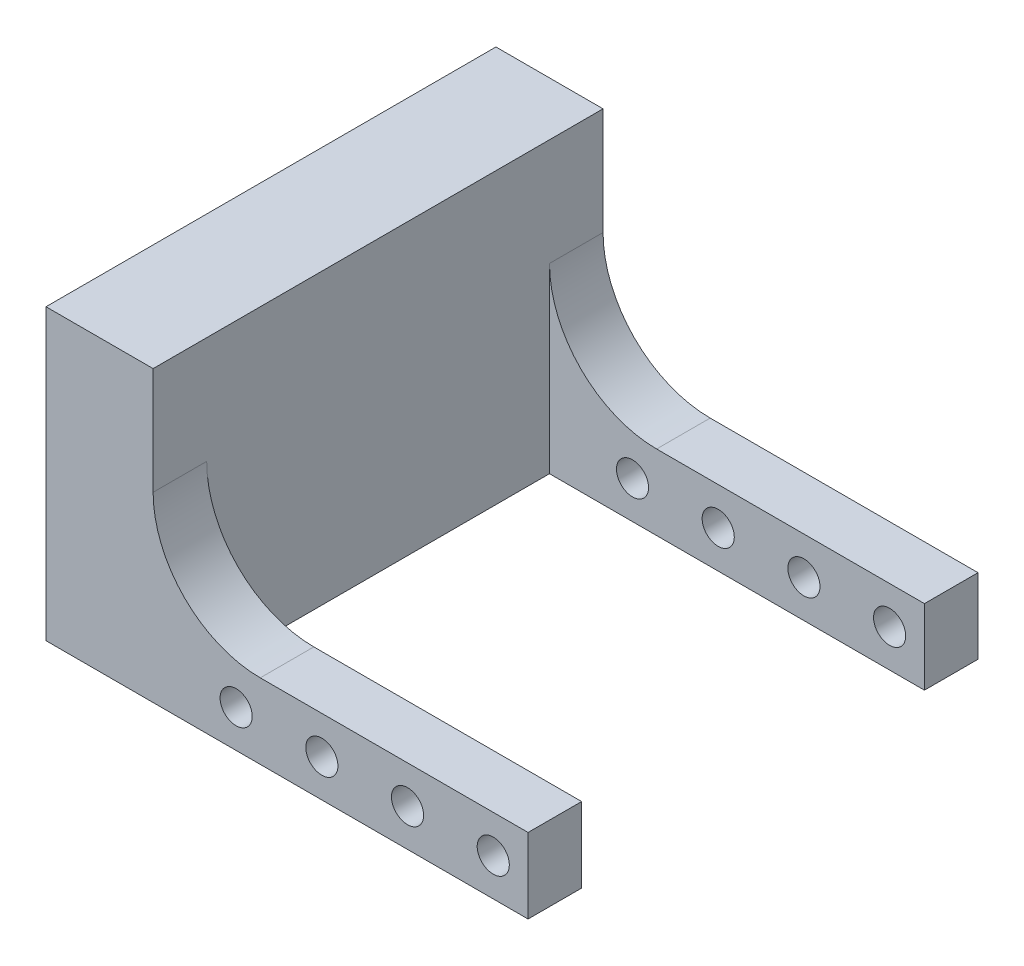
ISO-10303-21;
HEADER;
FILE_DESCRIPTION(('STEP AP214'),'2;1');
FILE_NAME('part.step','',(''),(''),'','','');
FILE_SCHEMA(('AUTOMOTIVE_DESIGN { 1 0 10303 214 1 1 1 1 }'));
ENDSEC;
DATA;
#1=APPLICATION_CONTEXT('core data for automotive mechanical design processes');
#2=APPLICATION_PROTOCOL_DEFINITION('international standard','automotive_design',2000,#1);
#3=PRODUCT_CONTEXT('',#1,'mechanical');
#4=PRODUCT('Part','Part','',(#3));
#5=PRODUCT_RELATED_PRODUCT_CATEGORY('part','',(#4));
#6=PRODUCT_DEFINITION_FORMATION('','',#4);
#7=PRODUCT_DEFINITION_CONTEXT('part definition',#1,'design');
#8=PRODUCT_DEFINITION('design','',#6,#7);
#9=PRODUCT_DEFINITION_SHAPE('','',#8);
#10=(LENGTH_UNIT() NAMED_UNIT(*) SI_UNIT(.MILLI.,.METRE.));
#11=(NAMED_UNIT(*) PLANE_ANGLE_UNIT() SI_UNIT($,.RADIAN.));
#12=(NAMED_UNIT(*) SI_UNIT($,.STERADIAN.) SOLID_ANGLE_UNIT());
#13=UNCERTAINTY_MEASURE_WITH_UNIT(LENGTH_MEASURE(1.E-05),#10,'distance_accuracy_value','');
#14=(GEOMETRIC_REPRESENTATION_CONTEXT(3) GLOBAL_UNCERTAINTY_ASSIGNED_CONTEXT((#13)) GLOBAL_UNIT_ASSIGNED_CONTEXT((#10,
#11,#12)) REPRESENTATION_CONTEXT('',''));
#15=CARTESIAN_POINT('',(0.,0.,0.));
#16=DIRECTION('',(0.,0.,1.));
#17=DIRECTION('',(1.,0.,0.));
#18=AXIS2_PLACEMENT_3D('',#15,#16,#17);
#19=CARTESIAN_POINT('',(35.,0.,42.));
#20=DIRECTION('',(-1.,0.,0.));
#21=DIRECTION('',(0.,0.,1.));
#22=AXIS2_PLACEMENT_3D('',#19,#20,#21);
#23=PLANE('',#22);
#24=DIRECTION('',(0.,0.,-1.));
#25=VECTOR('',#24,1.);
#26=CARTESIAN_POINT('',(35.,0.,42.));
#27=LINE('',#26,#25);
#28=CARTESIAN_POINT('',(35.,0.,42.));
#29=VERTEX_POINT('',#28);
#30=CARTESIAN_POINT('',(35.,0.,37.));
#31=VERTEX_POINT('',#30);
#32=EDGE_CURVE('E159',#29,#31,#27,.T.);
#33=ORIENTED_EDGE('',*,*,#32,.T.);
#34=DIRECTION('',(0.,1.,0.));
#35=VECTOR('',#34,1.);
#36=CARTESIAN_POINT('',(35.,0.,37.));
#37=LINE('',#36,#35);
#38=CARTESIAN_POINT('',(35.,7.,37.));
#39=VERTEX_POINT('',#38);
#40=EDGE_CURVE('E307',#31,#39,#37,.T.);
#41=ORIENTED_EDGE('',*,*,#40,.T.);
#42=DIRECTION('',(0.,0.,-1.));
#43=VECTOR('',#42,1.);
#44=CARTESIAN_POINT('',(35.,7.,42.));
#45=LINE('',#44,#43);
#46=CARTESIAN_POINT('',(35.,7.,42.));
#47=VERTEX_POINT('',#46);
#48=EDGE_CURVE('E160',#47,#39,#45,.T.);
#49=ORIENTED_EDGE('',*,*,#48,.F.);
#50=DIRECTION('',(0.,1.,0.));
#51=VECTOR('',#50,1.);
#52=CARTESIAN_POINT('',(35.,0.,42.));
#53=LINE('',#52,#51);
#54=EDGE_CURVE('E269',#29,#47,#53,.T.);
#55=ORIENTED_EDGE('',*,*,#54,.F.);
#56=EDGE_LOOP('',(#33,#41,#49,#55));
#57=FACE_BOUND('',#56,.T.);
#58=ADVANCED_FACE('F40',(#57),#23,.F.);
#59=CARTESIAN_POINT('',(0.,7.,42.));
#60=DIRECTION('',(0.,-1.,0.));
#61=DIRECTION('',(0.,0.,-1.));
#62=AXIS2_PLACEMENT_3D('',#59,#60,#61);
#63=PLANE('',#62);
#64=DIRECTION('',(1.,0.,0.));
#65=VECTOR('',#64,1.);
#66=CARTESIAN_POINT('',(35.,7.,37.));
#67=LINE('',#66,#65);
#68=CARTESIAN_POINT('',(10.,7.,37.));
#69=VERTEX_POINT('',#68);
#70=EDGE_CURVE('E142',#69,#39,#67,.T.);
#71=ORIENTED_EDGE('',*,*,#70,.F.);
#72=DIRECTION('',(0.,0.,-1.));
#73=VECTOR('',#72,1.);
#74=CARTESIAN_POINT('',(10.,7.,42.));
#75=LINE('',#74,#73);
#76=CARTESIAN_POINT('',(10.,7.,42.));
#77=VERTEX_POINT('',#76);
#78=EDGE_CURVE('E56',#69,#77,#75,.F.);
#79=ORIENTED_EDGE('',*,*,#78,.T.);
#80=DIRECTION('',(-1.,0.,0.));
#81=VECTOR('',#80,1.);
#82=CARTESIAN_POINT('',(0.,7.,42.));
#83=LINE('',#82,#81);
#84=EDGE_CURVE('E265',#47,#77,#83,.T.);
#85=ORIENTED_EDGE('',*,*,#84,.F.);
#86=ORIENTED_EDGE('',*,*,#48,.T.);
#87=EDGE_LOOP('',(#71,#79,#85,#86));
#88=FACE_BOUND('',#87,.T.);
#89=ADVANCED_FACE('F310',(#88),#63,.F.);
#90=CARTESIAN_POINT('',(0.,0.,42.));
#91=DIRECTION('',(0.,1.,0.));
#92=DIRECTION('',(0.,0.,1.));
#93=AXIS2_PLACEMENT_3D('',#90,#91,#92);
#94=PLANE('',#93);
#95=DIRECTION('',(0.,0.,1.));
#96=VECTOR('',#95,1.);
#97=CARTESIAN_POINT('',(0.,0.,37.));
#98=LINE('',#97,#96);
#99=CARTESIAN_POINT('',(0.,0.,5.));
#100=VERTEX_POINT('',#99);
#101=CARTESIAN_POINT('',(0.,0.,37.));
#102=VERTEX_POINT('',#101);
#103=EDGE_CURVE('E141',#100,#102,#98,.T.);
#104=ORIENTED_EDGE('',*,*,#103,.T.);
#105=DIRECTION('',(1.,0.,0.));
#106=VECTOR('',#105,1.);
#107=CARTESIAN_POINT('',(35.,0.,37.));
#108=LINE('',#107,#106);
#109=EDGE_CURVE('E152',#102,#31,#108,.T.);
#110=ORIENTED_EDGE('',*,*,#109,.T.);
#111=ORIENTED_EDGE('',*,*,#32,.F.);
#112=DIRECTION('',(1.,0.,0.));
#113=VECTOR('',#112,1.);
#114=CARTESIAN_POINT('',(0.,0.,42.));
#115=LINE('',#114,#113);
#116=CARTESIAN_POINT('',(-10.,0.,42.));
#117=VERTEX_POINT('',#116);
#118=EDGE_CURVE('E274',#117,#29,#115,.T.);
#119=ORIENTED_EDGE('',*,*,#118,.F.);
#120=DIRECTION('',(0.,0.,-1.));
#121=VECTOR('',#120,1.);
#122=CARTESIAN_POINT('',(-10.,0.,42.));
#123=LINE('',#122,#121);
#124=CARTESIAN_POINT('',(-10.,0.,0.));
#125=VERTEX_POINT('',#124);
#126=EDGE_CURVE('E247',#117,#125,#123,.T.);
#127=ORIENTED_EDGE('',*,*,#126,.T.);
#128=DIRECTION('',(1.,0.,0.));
#129=VECTOR('',#128,1.);
#130=CARTESIAN_POINT('',(0.,0.,0.));
#131=LINE('',#130,#129);
#132=CARTESIAN_POINT('',(35.,0.,0.));
#133=VERTEX_POINT('',#132);
#134=EDGE_CURVE('E156',#125,#133,#131,.T.);
#135=ORIENTED_EDGE('',*,*,#134,.T.);
#136=CARTESIAN_POINT('',(35.,0.,5.));
#137=VERTEX_POINT('',#136);
#138=EDGE_CURVE('E148',#137,#133,#27,.T.);
#139=ORIENTED_EDGE('',*,*,#138,.F.);
#140=DIRECTION('',(-1.,0.,0.));
#141=VECTOR('',#140,1.);
#142=CARTESIAN_POINT('',(35.,0.,5.));
#143=LINE('',#142,#141);
#144=EDGE_CURVE('E128',#137,#100,#143,.T.);
#145=ORIENTED_EDGE('',*,*,#144,.T.);
#146=EDGE_LOOP('',(#104,#110,#111,#119,#127,#135,#139,#145));
#147=FACE_BOUND('',#146,.T.);
#148=ADVANCED_FACE('F154',(#147),#94,.F.);
#149=CARTESIAN_POINT('',(35.,7.,5.));
#150=VERTEX_POINT('',#149);
#151=CARTESIAN_POINT('',(35.,7.,0.));
#152=VERTEX_POINT('',#151);
#153=EDGE_CURVE('E150',#150,#152,#45,.T.);
#154=ORIENTED_EDGE('',*,*,#153,.F.);
#155=DIRECTION('',(0.,1.,0.));
#156=VECTOR('',#155,1.);
#157=CARTESIAN_POINT('',(35.,0.,5.));
#158=LINE('',#157,#156);
#159=EDGE_CURVE('E132',#137,#150,#158,.T.);
#160=ORIENTED_EDGE('',*,*,#159,.F.);
#161=ORIENTED_EDGE('',*,*,#138,.T.);
#162=DIRECTION('',(0.,1.,0.));
#163=VECTOR('',#162,1.);
#164=CARTESIAN_POINT('',(35.,0.,0.));
#165=LINE('',#164,#163);
#166=EDGE_CURVE('E298',#133,#152,#165,.T.);
#167=ORIENTED_EDGE('',*,*,#166,.T.);
#168=EDGE_LOOP('',(#154,#160,#161,#167));
#169=FACE_BOUND('',#168,.T.);
#170=ADVANCED_FACE('F146',(#169),#23,.F.);
#171=DIRECTION('',(-1.,0.,0.));
#172=VECTOR('',#171,1.);
#173=CARTESIAN_POINT('',(0.,7.,0.));
#174=LINE('',#173,#172);
#175=CARTESIAN_POINT('',(10.,7.,0.));
#176=VERTEX_POINT('',#175);
#177=EDGE_CURVE('E293',#152,#176,#174,.T.);
#178=ORIENTED_EDGE('',*,*,#177,.T.);
#179=DIRECTION('',(0.,0.,-1.));
#180=VECTOR('',#179,1.);
#181=CARTESIAN_POINT('',(10.,7.,5.00000000000001));
#182=LINE('',#181,#180);
#183=CARTESIAN_POINT('',(10.,7.,5.));
#184=VERTEX_POINT('',#183);
#185=EDGE_CURVE('E199',#176,#184,#182,.F.);
#186=ORIENTED_EDGE('',*,*,#185,.T.);
#187=DIRECTION('',(-1.,0.,0.));
#188=VECTOR('',#187,1.);
#189=CARTESIAN_POINT('',(35.,7.,5.));
#190=LINE('',#189,#188);
#191=EDGE_CURVE('E409',#150,#184,#190,.T.);
#192=ORIENTED_EDGE('',*,*,#191,.F.);
#193=ORIENTED_EDGE('',*,*,#153,.T.);
#194=EDGE_LOOP('',(#178,#186,#192,#193));
#195=FACE_BOUND('',#194,.T.);
#196=ADVANCED_FACE('F316',(#195),#63,.F.);
#197=CARTESIAN_POINT('',(0.,7.,42.));
#198=DIRECTION('',(-1.,0.,0.));
#199=DIRECTION('',(0.,0.,1.));
#200=AXIS2_PLACEMENT_3D('',#197,#198,#199);
#201=PLANE('',#200);
#202=DIRECTION('',(0.,1.,0.));
#203=VECTOR('',#202,1.);
#204=CARTESIAN_POINT('',(0.,0.,5.));
#205=LINE('',#204,#203);
#206=CARTESIAN_POINT('',(0.,17.,5.));
#207=VERTEX_POINT('',#206);
#208=EDGE_CURVE('E135',#100,#207,#205,.T.);
#209=ORIENTED_EDGE('',*,*,#208,.T.);
#210=DIRECTION('',(0.,0.,-1.));
#211=VECTOR('',#210,1.);
#212=CARTESIAN_POINT('',(0.,17.,0.));
#213=LINE('',#212,#211);
#214=CARTESIAN_POINT('',(0.,17.,0.));
#215=VERTEX_POINT('',#214);
#216=EDGE_CURVE('E195',#207,#215,#213,.T.);
#217=ORIENTED_EDGE('',*,*,#216,.T.);
#218=DIRECTION('',(0.,1.,0.));
#219=VECTOR('',#218,1.);
#220=CARTESIAN_POINT('',(0.,7.,0.));
#221=LINE('',#220,#219);
#222=CARTESIAN_POINT('',(0.,27.,0.));
#223=VERTEX_POINT('',#222);
#224=EDGE_CURVE('E290',#215,#223,#221,.T.);
#225=ORIENTED_EDGE('',*,*,#224,.T.);
#226=DIRECTION('',(0.,0.,-1.));
#227=VECTOR('',#226,1.);
#228=CARTESIAN_POINT('',(0.,27.,42.));
#229=LINE('',#228,#227);
#230=CARTESIAN_POINT('',(0.,27.,42.));
#231=VERTEX_POINT('',#230);
#232=EDGE_CURVE('E237',#231,#223,#229,.T.);
#233=ORIENTED_EDGE('',*,*,#232,.F.);
#234=DIRECTION('',(0.,1.,0.));
#235=VECTOR('',#234,1.);
#236=CARTESIAN_POINT('',(0.,7.,42.));
#237=LINE('',#236,#235);
#238=CARTESIAN_POINT('',(0.,17.,42.));
#239=VERTEX_POINT('',#238);
#240=EDGE_CURVE('E262',#239,#231,#237,.T.);
#241=ORIENTED_EDGE('',*,*,#240,.F.);
#242=DIRECTION('',(0.,0.,-1.));
#243=VECTOR('',#242,1.);
#244=CARTESIAN_POINT('',(0.,17.,37.));
#245=LINE('',#244,#243);
#246=CARTESIAN_POINT('',(0.,17.,37.));
#247=VERTEX_POINT('',#246);
#248=EDGE_CURVE('E166',#239,#247,#245,.T.);
#249=ORIENTED_EDGE('',*,*,#248,.T.);
#250=DIRECTION('',(0.,1.,0.));
#251=VECTOR('',#250,1.);
#252=CARTESIAN_POINT('',(0.,0.,37.));
#253=LINE('',#252,#251);
#254=EDGE_CURVE('E385',#102,#247,#253,.T.);
#255=ORIENTED_EDGE('',*,*,#254,.F.);
#256=ORIENTED_EDGE('',*,*,#103,.F.);
#257=EDGE_LOOP('',(#209,#217,#225,#233,#241,#249,#255,#256));
#258=FACE_BOUND('',#257,.T.);
#259=ADVANCED_FACE('F346',(#258),#201,.F.);
#260=CARTESIAN_POINT('',(0.,27.,42.));
#261=DIRECTION('',(0.,-1.,0.));
#262=DIRECTION('',(0.,0.,-1.));
#263=AXIS2_PLACEMENT_3D('',#260,#261,#262);
#264=PLANE('',#263);
#265=DIRECTION('',(-1.,0.,0.));
#266=VECTOR('',#265,1.);
#267=CARTESIAN_POINT('',(0.,27.,0.));
#268=LINE('',#267,#266);
#269=CARTESIAN_POINT('',(-10.,27.,0.));
#270=VERTEX_POINT('',#269);
#271=EDGE_CURVE('E285',#223,#270,#268,.T.);
#272=ORIENTED_EDGE('',*,*,#271,.T.);
#273=DIRECTION('',(0.,0.,-1.));
#274=VECTOR('',#273,1.);
#275=CARTESIAN_POINT('',(-10.,27.,42.));
#276=LINE('',#275,#274);
#277=CARTESIAN_POINT('',(-10.,27.,42.));
#278=VERTEX_POINT('',#277);
#279=EDGE_CURVE('E242',#278,#270,#276,.T.);
#280=ORIENTED_EDGE('',*,*,#279,.F.);
#281=DIRECTION('',(-1.,0.,0.));
#282=VECTOR('',#281,1.);
#283=CARTESIAN_POINT('',(0.,27.,42.));
#284=LINE('',#283,#282);
#285=EDGE_CURVE('E257',#231,#278,#284,.T.);
#286=ORIENTED_EDGE('',*,*,#285,.F.);
#287=ORIENTED_EDGE('',*,*,#232,.T.);
#288=EDGE_LOOP('',(#272,#280,#286,#287));
#289=FACE_BOUND('',#288,.T.);
#290=ADVANCED_FACE('F616',(#289),#264,.F.);
#291=CARTESIAN_POINT('',(-10.,0.,42.));
#292=DIRECTION('',(1.,0.,0.));
#293=DIRECTION('',(0.,1.,0.));
#294=AXIS2_PLACEMENT_3D('',#291,#292,#293);
#295=PLANE('',#294);
#296=DIRECTION('',(0.,-1.,0.));
#297=VECTOR('',#296,1.);
#298=CARTESIAN_POINT('',(-10.,0.,0.));
#299=LINE('',#298,#297);
#300=EDGE_CURVE('E279',#270,#125,#299,.T.);
#301=ORIENTED_EDGE('',*,*,#300,.T.);
#302=ORIENTED_EDGE('',*,*,#126,.F.);
#303=DIRECTION('',(0.,-1.,0.));
#304=VECTOR('',#303,1.);
#305=CARTESIAN_POINT('',(-10.,0.,42.));
#306=LINE('',#305,#304);
#307=EDGE_CURVE('E252',#278,#117,#306,.T.);
#308=ORIENTED_EDGE('',*,*,#307,.F.);
#309=ORIENTED_EDGE('',*,*,#279,.T.);
#310=EDGE_LOOP('',(#301,#302,#308,#309));
#311=FACE_BOUND('',#310,.T.);
#312=ADVANCED_FACE('F609',(#311),#295,.F.);
#313=CARTESIAN_POINT('',(0.,0.,42.));
#314=DIRECTION('',(0.,0.,-1.));
#315=DIRECTION('',(-1.,0.,0.));
#316=AXIS2_PLACEMENT_3D('',#313,#314,#315);
#317=PLANE('',#316);
#318=CARTESIAN_POINT('',(31.75,3.50000000000016,42.));
#319=DIRECTION('',(0.,0.,1.));
#320=DIRECTION('',(1.,0.,0.));
#321=AXIS2_PLACEMENT_3D('',#318,#319,#320);
#322=CIRCLE('',#321,1.5);
#323=CARTESIAN_POINT('',(33.25,3.50000000000016,42.));
#324=VERTEX_POINT('',#323);
#325=EDGE_CURVE('E521',#324,#324,#322,.T.);
#326=ORIENTED_EDGE('',*,*,#325,.F.);
#327=EDGE_LOOP('',(#326));
#328=FACE_BOUND('',#327,.T.);
#329=CARTESIAN_POINT('',(23.75,3.50000000000011,42.));
#330=DIRECTION('',(0.,0.,1.));
#331=DIRECTION('',(1.,0.,0.));
#332=AXIS2_PLACEMENT_3D('',#329,#330,#331);
#333=CIRCLE('',#332,1.5);
#334=CARTESIAN_POINT('',(25.25,3.50000000000011,42.));
#335=VERTEX_POINT('',#334);
#336=EDGE_CURVE('E533',#335,#335,#333,.T.);
#337=ORIENTED_EDGE('',*,*,#336,.F.);
#338=EDGE_LOOP('',(#337));
#339=FACE_BOUND('',#338,.T.);
#340=CARTESIAN_POINT('',(15.75,3.50000000000005,42.));
#341=DIRECTION('',(0.,0.,1.));
#342=DIRECTION('',(1.,0.,0.));
#343=AXIS2_PLACEMENT_3D('',#340,#341,#342);
#344=CIRCLE('',#343,1.5);
#345=CARTESIAN_POINT('',(17.25,3.50000000000005,42.));
#346=VERTEX_POINT('',#345);
#347=EDGE_CURVE('E545',#346,#346,#344,.T.);
#348=ORIENTED_EDGE('',*,*,#347,.F.);
#349=EDGE_LOOP('',(#348));
#350=FACE_BOUND('',#349,.T.);
#351=CARTESIAN_POINT('',(7.75,3.5,42.));
#352=DIRECTION('',(0.,0.,1.));
#353=DIRECTION('',(1.,0.,0.));
#354=AXIS2_PLACEMENT_3D('',#351,#352,#353);
#355=CIRCLE('',#354,1.5);
#356=CARTESIAN_POINT('',(9.25,3.5,42.));
#357=VERTEX_POINT('',#356);
#358=EDGE_CURVE('E557',#357,#357,#355,.T.);
#359=ORIENTED_EDGE('',*,*,#358,.F.);
#360=EDGE_LOOP('',(#359));
#361=FACE_BOUND('',#360,.T.);
#362=ORIENTED_EDGE('',*,*,#118,.T.);
#363=ORIENTED_EDGE('',*,*,#54,.T.);
#364=ORIENTED_EDGE('',*,*,#84,.T.);
#365=CARTESIAN_POINT('',(10.,17.,42.));
#366=DIRECTION('',(0.,0.,-1.));
#367=DIRECTION('',(-1.,0.,0.));
#368=AXIS2_PLACEMENT_3D('',#365,#366,#367);
#369=CIRCLE('',#368,10.);
#370=EDGE_CURVE('E11',#77,#239,#369,.T.);
#371=ORIENTED_EDGE('',*,*,#370,.T.);
#372=ORIENTED_EDGE('',*,*,#240,.T.);
#373=ORIENTED_EDGE('',*,*,#285,.T.);
#374=ORIENTED_EDGE('',*,*,#307,.T.);
#375=EDGE_LOOP('',(#362,#363,#364,#371,#372,#373,#374));
#376=FACE_BOUND('',#375,.T.);
#377=ADVANCED_FACE('F603',(#328,#339,#350,#361,#376),#317,.F.);
#378=CARTESIAN_POINT('',(0.,0.,0.));
#379=DIRECTION('',(0.,0.,-1.));
#380=DIRECTION('',(-1.,0.,0.));
#381=AXIS2_PLACEMENT_3D('',#378,#379,#380);
#382=PLANE('',#381);
#383=CARTESIAN_POINT('',(31.75,3.50000000000016,0.));
#384=DIRECTION('',(0.,0.,1.));
#385=DIRECTION('',(1.,0.,0.));
#386=AXIS2_PLACEMENT_3D('',#383,#384,#385);
#387=CIRCLE('',#386,1.5);
#388=CARTESIAN_POINT('',(33.25,3.50000000000016,0.));
#389=VERTEX_POINT('',#388);
#390=EDGE_CURVE('E176',#389,#389,#387,.T.);
#391=ORIENTED_EDGE('',*,*,#390,.T.);
#392=EDGE_LOOP('',(#391));
#393=FACE_BOUND('',#392,.T.);
#394=CARTESIAN_POINT('',(23.75,3.50000000000011,0.));
#395=DIRECTION('',(0.,0.,1.));
#396=DIRECTION('',(1.,0.,0.));
#397=AXIS2_PLACEMENT_3D('',#394,#395,#396);
#398=CIRCLE('',#397,1.5);
#399=CARTESIAN_POINT('',(25.25,3.50000000000011,0.));
#400=VERTEX_POINT('',#399);
#401=EDGE_CURVE('E527',#400,#400,#398,.T.);
#402=ORIENTED_EDGE('',*,*,#401,.T.);
#403=EDGE_LOOP('',(#402));
#404=FACE_BOUND('',#403,.T.);
#405=CARTESIAN_POINT('',(15.75,3.50000000000005,0.));
#406=DIRECTION('',(0.,0.,1.));
#407=DIRECTION('',(1.,0.,0.));
#408=AXIS2_PLACEMENT_3D('',#405,#406,#407);
#409=CIRCLE('',#408,1.5);
#410=CARTESIAN_POINT('',(17.25,3.50000000000005,0.));
#411=VERTEX_POINT('',#410);
#412=EDGE_CURVE('E539',#411,#411,#409,.T.);
#413=ORIENTED_EDGE('',*,*,#412,.T.);
#414=EDGE_LOOP('',(#413));
#415=FACE_BOUND('',#414,.T.);
#416=CARTESIAN_POINT('',(7.75,3.5,0.));
#417=DIRECTION('',(0.,0.,1.));
#418=DIRECTION('',(1.,0.,0.));
#419=AXIS2_PLACEMENT_3D('',#416,#417,#418);
#420=CIRCLE('',#419,1.5);
#421=CARTESIAN_POINT('',(9.25,3.5,0.));
#422=VERTEX_POINT('',#421);
#423=EDGE_CURVE('E551',#422,#422,#420,.T.);
#424=ORIENTED_EDGE('',*,*,#423,.T.);
#425=EDGE_LOOP('',(#424));
#426=FACE_BOUND('',#425,.T.);
#427=ORIENTED_EDGE('',*,*,#134,.F.);
#428=ORIENTED_EDGE('',*,*,#300,.F.);
#429=ORIENTED_EDGE('',*,*,#271,.F.);
#430=ORIENTED_EDGE('',*,*,#224,.F.);
#431=CARTESIAN_POINT('',(10.,17.,0.));
#432=DIRECTION('',(0.,0.,-1.));
#433=DIRECTION('',(-1.,0.,0.));
#434=AXIS2_PLACEMENT_3D('',#431,#432,#433);
#435=CIRCLE('',#434,10.);
#436=EDGE_CURVE('E204',#215,#176,#435,.F.);
#437=ORIENTED_EDGE('',*,*,#436,.T.);
#438=ORIENTED_EDGE('',*,*,#177,.F.);
#439=ORIENTED_EDGE('',*,*,#166,.F.);
#440=EDGE_LOOP('',(#427,#428,#429,#430,#437,#438,#439));
#441=FACE_BOUND('',#440,.T.);
#442=ADVANCED_FACE('F229',(#393,#404,#415,#426,#441),#382,.T.);
#443=CARTESIAN_POINT('',(35.,0.,37.));
#444=DIRECTION('',(0.,0.,1.));
#445=DIRECTION('',(1.,0.,0.));
#446=AXIS2_PLACEMENT_3D('',#443,#444,#445);
#447=PLANE('',#446);
#448=CARTESIAN_POINT('',(31.75,3.50000000000016,37.));
#449=DIRECTION('',(0.,0.,1.));
#450=DIRECTION('',(1.,0.,0.));
#451=AXIS2_PLACEMENT_3D('',#448,#449,#450);
#452=CIRCLE('',#451,1.5);
#453=CARTESIAN_POINT('',(33.25,3.50000000000016,37.));
#454=VERTEX_POINT('',#453);
#455=EDGE_CURVE('E191',#454,#454,#452,.T.);
#456=ORIENTED_EDGE('',*,*,#455,.T.);
#457=EDGE_LOOP('',(#456));
#458=FACE_BOUND('',#457,.T.);
#459=CARTESIAN_POINT('',(23.75,3.50000000000011,37.));
#460=DIRECTION('',(0.,0.,1.));
#461=DIRECTION('',(1.,0.,0.));
#462=AXIS2_PLACEMENT_3D('',#459,#460,#461);
#463=CIRCLE('',#462,1.5);
#464=CARTESIAN_POINT('',(25.25,3.50000000000011,37.));
#465=VERTEX_POINT('',#464);
#466=EDGE_CURVE('E186',#465,#465,#463,.T.);
#467=ORIENTED_EDGE('',*,*,#466,.T.);
#468=EDGE_LOOP('',(#467));
#469=FACE_BOUND('',#468,.T.);
#470=CARTESIAN_POINT('',(15.75,3.50000000000005,37.));
#471=DIRECTION('',(0.,0.,1.));
#472=DIRECTION('',(1.,0.,0.));
#473=AXIS2_PLACEMENT_3D('',#470,#471,#472);
#474=CIRCLE('',#473,1.5);
#475=CARTESIAN_POINT('',(17.25,3.50000000000005,37.));
#476=VERTEX_POINT('',#475);
#477=EDGE_CURVE('E181',#476,#476,#474,.T.);
#478=ORIENTED_EDGE('',*,*,#477,.T.);
#479=EDGE_LOOP('',(#478));
#480=FACE_BOUND('',#479,.T.);
#481=CARTESIAN_POINT('',(7.75,3.5,37.));
#482=DIRECTION('',(0.,0.,1.));
#483=DIRECTION('',(1.,0.,0.));
#484=AXIS2_PLACEMENT_3D('',#481,#482,#483);
#485=CIRCLE('',#484,1.5);
#486=CARTESIAN_POINT('',(9.25,3.5,37.));
#487=VERTEX_POINT('',#486);
#488=EDGE_CURVE('E175',#487,#487,#485,.T.);
#489=ORIENTED_EDGE('',*,*,#488,.T.);
#490=EDGE_LOOP('',(#489));
#491=FACE_BOUND('',#490,.T.);
#492=ORIENTED_EDGE('',*,*,#254,.T.);
#493=CARTESIAN_POINT('',(10.,17.,37.));
#494=DIRECTION('',(0.,0.,1.));
#495=DIRECTION('',(1.,0.,0.));
#496=AXIS2_PLACEMENT_3D('',#493,#494,#495);
#497=CIRCLE('',#496,10.);
#498=EDGE_CURVE('E49',#247,#69,#497,.T.);
#499=ORIENTED_EDGE('',*,*,#498,.T.);
#500=ORIENTED_EDGE('',*,*,#70,.T.);
#501=ORIENTED_EDGE('',*,*,#40,.F.);
#502=ORIENTED_EDGE('',*,*,#109,.F.);
#503=EDGE_LOOP('',(#492,#499,#500,#501,#502));
#504=FACE_BOUND('',#503,.T.);
#505=ADVANCED_FACE('F353',(#458,#469,#480,#491,#504),#447,.F.);
#506=CARTESIAN_POINT('',(35.,0.,5.));
#507=DIRECTION('',(0.,0.,-1.));
#508=DIRECTION('',(-1.,0.,0.));
#509=AXIS2_PLACEMENT_3D('',#506,#507,#508);
#510=PLANE('',#509);
#511=CARTESIAN_POINT('',(31.75,3.50000000000016,5.));
#512=DIRECTION('',(0.,0.,-1.));
#513=DIRECTION('',(-1.,0.,0.));
#514=AXIS2_PLACEMENT_3D('',#511,#512,#513);
#515=CIRCLE('',#514,1.5);
#516=CARTESIAN_POINT('',(30.25,3.50000000000016,5.));
#517=VERTEX_POINT('',#516);
#518=EDGE_CURVE('E187',#517,#517,#515,.T.);
#519=ORIENTED_EDGE('',*,*,#518,.T.);
#520=EDGE_LOOP('',(#519));
#521=FACE_BOUND('',#520,.T.);
#522=CARTESIAN_POINT('',(23.75,3.50000000000011,5.));
#523=DIRECTION('',(0.,0.,-1.));
#524=DIRECTION('',(-1.,0.,0.));
#525=AXIS2_PLACEMENT_3D('',#522,#523,#524);
#526=CIRCLE('',#525,1.5);
#527=CARTESIAN_POINT('',(22.25,3.50000000000011,5.));
#528=VERTEX_POINT('',#527);
#529=EDGE_CURVE('E182',#528,#528,#526,.T.);
#530=ORIENTED_EDGE('',*,*,#529,.T.);
#531=EDGE_LOOP('',(#530));
#532=FACE_BOUND('',#531,.T.);
#533=CARTESIAN_POINT('',(15.75,3.50000000000005,5.));
#534=DIRECTION('',(0.,0.,-1.));
#535=DIRECTION('',(-1.,0.,0.));
#536=AXIS2_PLACEMENT_3D('',#533,#534,#535);
#537=CIRCLE('',#536,1.5);
#538=CARTESIAN_POINT('',(14.25,3.50000000000005,5.));
#539=VERTEX_POINT('',#538);
#540=EDGE_CURVE('E177',#539,#539,#537,.T.);
#541=ORIENTED_EDGE('',*,*,#540,.T.);
#542=EDGE_LOOP('',(#541));
#543=FACE_BOUND('',#542,.T.);
#544=CARTESIAN_POINT('',(7.75,3.5,5.));
#545=DIRECTION('',(0.,0.,-1.));
#546=DIRECTION('',(-1.,0.,0.));
#547=AXIS2_PLACEMENT_3D('',#544,#545,#546);
#548=CIRCLE('',#547,1.5);
#549=CARTESIAN_POINT('',(6.25,3.5,5.));
#550=VERTEX_POINT('',#549);
#551=EDGE_CURVE('E171',#550,#550,#548,.T.);
#552=ORIENTED_EDGE('',*,*,#551,.T.);
#553=EDGE_LOOP('',(#552));
#554=FACE_BOUND('',#553,.T.);
#555=ORIENTED_EDGE('',*,*,#191,.T.);
#556=CARTESIAN_POINT('',(10.,17.,5.));
#557=DIRECTION('',(0.,0.,-1.));
#558=DIRECTION('',(-1.,0.,0.));
#559=AXIS2_PLACEMENT_3D('',#556,#557,#558);
#560=CIRCLE('',#559,10.);
#561=EDGE_CURVE('E207',#184,#207,#560,.T.);
#562=ORIENTED_EDGE('',*,*,#561,.T.);
#563=ORIENTED_EDGE('',*,*,#208,.F.);
#564=ORIENTED_EDGE('',*,*,#144,.F.);
#565=ORIENTED_EDGE('',*,*,#159,.T.);
#566=EDGE_LOOP('',(#555,#562,#563,#564,#565));
#567=FACE_BOUND('',#566,.T.);
#568=ADVANCED_FACE('F131',(#521,#532,#543,#554,#567),#510,.F.);
#569=CARTESIAN_POINT('',(7.75,3.5,0.));
#570=DIRECTION('',(0.,0.,1.));
#571=DIRECTION('',(1.,0.,0.));
#572=AXIS2_PLACEMENT_3D('',#569,#570,#571);
#573=CYLINDRICAL_SURFACE('',#572,1.5);
#574=ORIENTED_EDGE('',*,*,#423,.F.);
#575=EDGE_LOOP('',(#574));
#576=FACE_BOUND('',#575,.T.);
#577=ORIENTED_EDGE('',*,*,#551,.F.);
#578=EDGE_LOOP('',(#577));
#579=FACE_BOUND('',#578,.T.);
#580=ADVANCED_FACE('F369',(#576,#579),#573,.F.);
#581=CARTESIAN_POINT('',(15.75,3.50000000000005,0.));
#582=DIRECTION('',(0.,0.,1.));
#583=DIRECTION('',(1.,0.,0.));
#584=AXIS2_PLACEMENT_3D('',#581,#582,#583);
#585=CYLINDRICAL_SURFACE('',#584,1.5);
#586=ORIENTED_EDGE('',*,*,#412,.F.);
#587=EDGE_LOOP('',(#586));
#588=FACE_BOUND('',#587,.T.);
#589=ORIENTED_EDGE('',*,*,#540,.F.);
#590=EDGE_LOOP('',(#589));
#591=FACE_BOUND('',#590,.T.);
#592=ADVANCED_FACE('F419',(#588,#591),#585,.F.);
#593=CARTESIAN_POINT('',(23.75,3.50000000000011,0.));
#594=DIRECTION('',(0.,0.,1.));
#595=DIRECTION('',(1.,0.,0.));
#596=AXIS2_PLACEMENT_3D('',#593,#594,#595);
#597=CYLINDRICAL_SURFACE('',#596,1.5);
#598=ORIENTED_EDGE('',*,*,#401,.F.);
#599=EDGE_LOOP('',(#598));
#600=FACE_BOUND('',#599,.T.);
#601=ORIENTED_EDGE('',*,*,#529,.F.);
#602=EDGE_LOOP('',(#601));
#603=FACE_BOUND('',#602,.T.);
#604=ADVANCED_FACE('F429',(#600,#603),#597,.F.);
#605=CARTESIAN_POINT('',(31.75,3.50000000000016,0.));
#606=DIRECTION('',(0.,0.,1.));
#607=DIRECTION('',(1.,0.,0.));
#608=AXIS2_PLACEMENT_3D('',#605,#606,#607);
#609=CYLINDRICAL_SURFACE('',#608,1.5);
#610=ORIENTED_EDGE('',*,*,#390,.F.);
#611=EDGE_LOOP('',(#610));
#612=FACE_BOUND('',#611,.T.);
#613=ORIENTED_EDGE('',*,*,#518,.F.);
#614=EDGE_LOOP('',(#613));
#615=FACE_BOUND('',#614,.T.);
#616=ADVANCED_FACE('F440',(#612,#615),#609,.F.);
#617=ORIENTED_EDGE('',*,*,#358,.T.);
#618=EDGE_LOOP('',(#617));
#619=FACE_BOUND('',#618,.T.);
#620=ORIENTED_EDGE('',*,*,#488,.F.);
#621=EDGE_LOOP('',(#620));
#622=FACE_BOUND('',#621,.T.);
#623=ADVANCED_FACE('F422',(#619,#622),#573,.F.);
#624=ORIENTED_EDGE('',*,*,#347,.T.);
#625=EDGE_LOOP('',(#624));
#626=FACE_BOUND('',#625,.T.);
#627=ORIENTED_EDGE('',*,*,#477,.F.);
#628=EDGE_LOOP('',(#627));
#629=FACE_BOUND('',#628,.T.);
#630=ADVANCED_FACE('F432',(#626,#629),#585,.F.);
#631=ORIENTED_EDGE('',*,*,#336,.T.);
#632=EDGE_LOOP('',(#631));
#633=FACE_BOUND('',#632,.T.);
#634=ORIENTED_EDGE('',*,*,#466,.F.);
#635=EDGE_LOOP('',(#634));
#636=FACE_BOUND('',#635,.T.);
#637=ADVANCED_FACE('F443',(#633,#636),#597,.F.);
#638=ORIENTED_EDGE('',*,*,#325,.T.);
#639=EDGE_LOOP('',(#638));
#640=FACE_BOUND('',#639,.T.);
#641=ORIENTED_EDGE('',*,*,#455,.F.);
#642=EDGE_LOOP('',(#641));
#643=FACE_BOUND('',#642,.T.);
#644=ADVANCED_FACE('F453',(#640,#643),#609,.F.);
#645=CARTESIAN_POINT('',(10.,17.,42.));
#646=DIRECTION('',(0.,0.,1.));
#647=DIRECTION('',(1.,0.,0.));
#648=AXIS2_PLACEMENT_3D('',#645,#646,#647);
#649=CYLINDRICAL_SURFACE('',#648,10.);
#650=ORIENTED_EDGE('',*,*,#561,.F.);
#651=ORIENTED_EDGE('',*,*,#185,.F.);
#652=ORIENTED_EDGE('',*,*,#436,.F.);
#653=ORIENTED_EDGE('',*,*,#216,.F.);
#654=EDGE_LOOP('',(#650,#651,#652,#653));
#655=FACE_BOUND('',#654,.T.);
#656=ADVANCED_FACE('F485',(#655),#649,.F.);
#657=CARTESIAN_POINT('',(10.,17.,42.));
#658=DIRECTION('',(0.,0.,1.));
#659=DIRECTION('',(1.,0.,0.));
#660=AXIS2_PLACEMENT_3D('',#657,#658,#659);
#661=CYLINDRICAL_SURFACE('',#660,10.);
#662=ORIENTED_EDGE('',*,*,#370,.F.);
#663=ORIENTED_EDGE('',*,*,#78,.F.);
#664=ORIENTED_EDGE('',*,*,#498,.F.);
#665=ORIENTED_EDGE('',*,*,#248,.F.);
#666=EDGE_LOOP('',(#662,#663,#664,#665));
#667=FACE_BOUND('',#666,.T.);
#668=ADVANCED_FACE('F42',(#667),#661,.F.);
#669=CLOSED_SHELL('',(#58,#89,#148,#170,#196,#259,#290,#312,#377,#442,#505,#568,#580,#592,#604,
#616,#623,#630,#637,#644,#656,#668));
#670=MANIFOLD_SOLID_BREP('B2',#669);
#671=ADVANCED_BREP_SHAPE_REPRESENTATION('',(#18,#670),#14);
#672=SHAPE_DEFINITION_REPRESENTATION(#9,#671);
ENDSEC;
END-ISO-10303-21;
